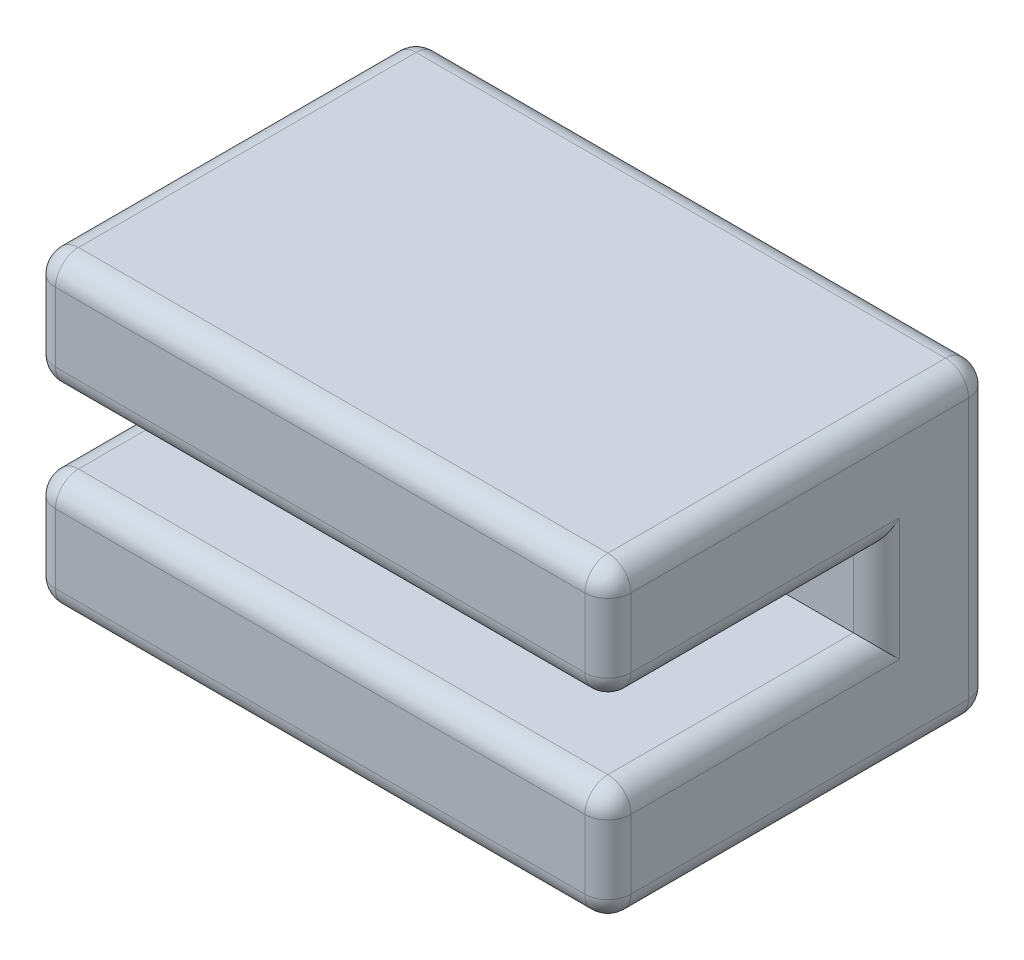
ISO-10303-21;
HEADER;
FILE_DESCRIPTION(('STEP AP214'),'2;1');
FILE_NAME('part.step','',(''),(''),'','','');
FILE_SCHEMA(('AUTOMOTIVE_DESIGN { 1 0 10303 214 1 1 1 1 }'));
ENDSEC;
DATA;
#1=APPLICATION_CONTEXT('core data for automotive mechanical design processes');
#2=APPLICATION_PROTOCOL_DEFINITION('international standard','automotive_design',2000,#1);
#3=PRODUCT_CONTEXT('',#1,'mechanical');
#4=PRODUCT('Part','Part','',(#3));
#5=PRODUCT_RELATED_PRODUCT_CATEGORY('part','',(#4));
#6=PRODUCT_DEFINITION_FORMATION('','',#4);
#7=PRODUCT_DEFINITION_CONTEXT('part definition',#1,'design');
#8=PRODUCT_DEFINITION('design','',#6,#7);
#9=PRODUCT_DEFINITION_SHAPE('','',#8);
#10=(LENGTH_UNIT() NAMED_UNIT(*) SI_UNIT(.MILLI.,.METRE.));
#11=(NAMED_UNIT(*) PLANE_ANGLE_UNIT() SI_UNIT($,.RADIAN.));
#12=(NAMED_UNIT(*) SI_UNIT($,.STERADIAN.) SOLID_ANGLE_UNIT());
#13=UNCERTAINTY_MEASURE_WITH_UNIT(LENGTH_MEASURE(1.E-05),#10,'distance_accuracy_value','');
#14=(GEOMETRIC_REPRESENTATION_CONTEXT(3) GLOBAL_UNCERTAINTY_ASSIGNED_CONTEXT((#13)) GLOBAL_UNIT_ASSIGNED_CONTEXT((#10,
#11,#12)) REPRESENTATION_CONTEXT('',''));
#15=CARTESIAN_POINT('',(0.,0.,0.));
#16=DIRECTION('',(0.,0.,1.));
#17=DIRECTION('',(1.,0.,0.));
#18=AXIS2_PLACEMENT_3D('',#15,#16,#17);
#19=CARTESIAN_POINT('',(0.,0.,10.));
#20=DIRECTION('',(0.,0.,1.));
#21=DIRECTION('',(1.,0.,0.));
#22=AXIS2_PLACEMENT_3D('',#19,#20,#21);
#23=PLANE('',#22);
#24=DIRECTION('',(0.,1.,0.));
#25=VECTOR('',#24,1.);
#26=CARTESIAN_POINT('',(-0.6,8.,10.));
#27=LINE('',#26,#25);
#28=CARTESIAN_POINT('',(-0.6,5.6,10.));
#29=VERTEX_POINT('',#28);
#30=CARTESIAN_POINT('',(-0.6,7.4,10.));
#31=VERTEX_POINT('',#30);
#32=EDGE_CURVE('E288',#29,#31,#27,.T.);
#33=ORIENTED_EDGE('',*,*,#32,.T.);
#34=DIRECTION('',(-1.,0.,0.));
#35=VECTOR('',#34,1.);
#36=CARTESIAN_POINT('',(-15.,7.4,10.));
#37=LINE('',#36,#35);
#38=CARTESIAN_POINT('',(-14.4,7.4,10.));
#39=VERTEX_POINT('',#38);
#40=EDGE_CURVE('E291',#31,#39,#37,.T.);
#41=ORIENTED_EDGE('',*,*,#40,.T.);
#42=DIRECTION('',(0.,-1.,0.));
#43=VECTOR('',#42,1.);
#44=CARTESIAN_POINT('',(-14.4,5.,10.));
#45=LINE('',#44,#43);
#46=CARTESIAN_POINT('',(-14.4,5.6,10.));
#47=VERTEX_POINT('',#46);
#48=EDGE_CURVE('E282',#39,#47,#45,.T.);
#49=ORIENTED_EDGE('',*,*,#48,.T.);
#50=DIRECTION('',(-1.,0.,0.));
#51=VECTOR('',#50,1.);
#52=CARTESIAN_POINT('',(0.,5.6,10.));
#53=LINE('',#52,#51);
#54=EDGE_CURVE('E285',#47,#29,#53,.F.);
#55=ORIENTED_EDGE('',*,*,#54,.T.);
#56=EDGE_LOOP('',(#33,#41,#49,#55));
#57=FACE_BOUND('',#56,.T.);
#58=ADVANCED_FACE('F39',(#57),#23,.T.);
#59=CARTESIAN_POINT('',(0.,0.,10.));
#60=DIRECTION('',(-1.,0.,0.));
#61=DIRECTION('',(0.,0.,1.));
#62=AXIS2_PLACEMENT_3D('',#59,#60,#61);
#63=PLANE('',#62);
#64=DIRECTION('',(0.,0.,1.));
#65=VECTOR('',#64,1.);
#66=CARTESIAN_POINT('',(0.,5.6,10.));
#67=LINE('',#66,#65);
#68=CARTESIAN_POINT('',(0.,5.6,9.4));
#69=VERTEX_POINT('',#68);
#70=CARTESIAN_POINT('',(0.,5.6,2.4));
#71=VERTEX_POINT('',#70);
#72=EDGE_CURVE('E251',#69,#71,#67,.F.);
#73=ORIENTED_EDGE('',*,*,#72,.T.);
#74=DIRECTION('',(0.,1.,0.));
#75=VECTOR('',#74,1.);
#76=CARTESIAN_POINT('',(0.,0.,2.4));
#77=LINE('',#76,#75);
#78=CARTESIAN_POINT('',(0.,2.4,2.4));
#79=VERTEX_POINT('',#78);
#80=EDGE_CURVE('E254',#71,#79,#77,.F.);
#81=ORIENTED_EDGE('',*,*,#80,.T.);
#82=DIRECTION('',(0.,0.,1.));
#83=VECTOR('',#82,1.);
#84=CARTESIAN_POINT('',(0.,2.4,10.));
#85=LINE('',#84,#83);
#86=CARTESIAN_POINT('',(0.,2.4,9.4));
#87=VERTEX_POINT('',#86);
#88=EDGE_CURVE('E243',#79,#87,#85,.T.);
#89=ORIENTED_EDGE('',*,*,#88,.T.);
#90=DIRECTION('',(0.,1.,0.));
#91=VECTOR('',#90,1.);
#92=CARTESIAN_POINT('',(0.,0.,9.4));
#93=LINE('',#92,#91);
#94=CARTESIAN_POINT('',(0.,0.6,9.4));
#95=VERTEX_POINT('',#94);
#96=EDGE_CURVE('E240',#87,#95,#93,.F.);
#97=ORIENTED_EDGE('',*,*,#96,.T.);
#98=DIRECTION('',(0.,0.,-1.));
#99=VECTOR('',#98,1.);
#100=CARTESIAN_POINT('',(0.,0.6,10.));
#101=LINE('',#100,#99);
#102=CARTESIAN_POINT('',(0.,0.6,0.6));
#103=VERTEX_POINT('',#102);
#104=EDGE_CURVE('E233',#95,#103,#101,.T.);
#105=ORIENTED_EDGE('',*,*,#104,.T.);
#106=DIRECTION('',(0.,1.,0.));
#107=VECTOR('',#106,1.);
#108=CARTESIAN_POINT('',(0.,0.,0.6));
#109=LINE('',#108,#107);
#110=CARTESIAN_POINT('',(0.,7.4,0.6));
#111=VERTEX_POINT('',#110);
#112=EDGE_CURVE('E229',#103,#111,#109,.T.);
#113=ORIENTED_EDGE('',*,*,#112,.T.);
#114=DIRECTION('',(0.,0.,-1.));
#115=VECTOR('',#114,1.);
#116=CARTESIAN_POINT('',(0.,7.4,10.));
#117=LINE('',#116,#115);
#118=CARTESIAN_POINT('',(0.,7.4,9.4));
#119=VERTEX_POINT('',#118);
#120=EDGE_CURVE('E196',#111,#119,#117,.F.);
#121=ORIENTED_EDGE('',*,*,#120,.T.);
#122=DIRECTION('',(0.,1.,0.));
#123=VECTOR('',#122,1.);
#124=CARTESIAN_POINT('',(0.,5.,9.4));
#125=LINE('',#124,#123);
#126=EDGE_CURVE('E248',#119,#69,#125,.F.);
#127=ORIENTED_EDGE('',*,*,#126,.T.);
#128=EDGE_LOOP('',(#73,#81,#89,#97,#105,#113,#121,#127));
#129=FACE_BOUND('',#128,.T.);
#130=ADVANCED_FACE('F534',(#129),#63,.F.);
#131=CARTESIAN_POINT('',(0.,8.,10.));
#132=DIRECTION('',(0.,-1.,0.));
#133=DIRECTION('',(1.,0.,0.));
#134=AXIS2_PLACEMENT_3D('',#131,#132,#133);
#135=PLANE('',#134);
#136=DIRECTION('',(-1.,0.,0.));
#137=VECTOR('',#136,1.);
#138=CARTESIAN_POINT('',(0.,8.,9.4));
#139=LINE('',#138,#137);
#140=CARTESIAN_POINT('',(-14.4,8.,9.4));
#141=VERTEX_POINT('',#140);
#142=CARTESIAN_POINT('',(-0.6,8.,9.4));
#143=VERTEX_POINT('',#142);
#144=EDGE_CURVE('E226',#141,#143,#139,.F.);
#145=ORIENTED_EDGE('',*,*,#144,.T.);
#146=DIRECTION('',(0.,0.,-1.));
#147=VECTOR('',#146,1.);
#148=CARTESIAN_POINT('',(-0.6,8.,10.));
#149=LINE('',#148,#147);
#150=CARTESIAN_POINT('',(-0.6,8.,0.6));
#151=VERTEX_POINT('',#150);
#152=EDGE_CURVE('E194',#143,#151,#149,.T.);
#153=ORIENTED_EDGE('',*,*,#152,.T.);
#154=DIRECTION('',(-1.,0.,0.));
#155=VECTOR('',#154,1.);
#156=CARTESIAN_POINT('',(0.,8.,0.6));
#157=LINE('',#156,#155);
#158=CARTESIAN_POINT('',(-14.4,8.,0.6));
#159=VERTEX_POINT('',#158);
#160=EDGE_CURVE('E214',#151,#159,#157,.T.);
#161=ORIENTED_EDGE('',*,*,#160,.T.);
#162=DIRECTION('',(0.,0.,-1.));
#163=VECTOR('',#162,1.);
#164=CARTESIAN_POINT('',(-14.4,8.,10.));
#165=LINE('',#164,#163);
#166=EDGE_CURVE('E221',#159,#141,#165,.F.);
#167=ORIENTED_EDGE('',*,*,#166,.T.);
#168=EDGE_LOOP('',(#145,#153,#161,#167));
#169=FACE_BOUND('',#168,.T.);
#170=ADVANCED_FACE('F224',(#169),#135,.F.);
#171=CARTESIAN_POINT('',(-15.,0.,10.));
#172=DIRECTION('',(1.,0.,0.));
#173=DIRECTION('',(0.,0.,-1.));
#174=AXIS2_PLACEMENT_3D('',#171,#172,#173);
#175=PLANE('',#174);
#176=DIRECTION('',(0.,0.,1.));
#177=VECTOR('',#176,1.);
#178=CARTESIAN_POINT('',(-15.,5.6,10.));
#179=LINE('',#178,#177);
#180=CARTESIAN_POINT('',(-15.,5.6,2.4));
#181=VERTEX_POINT('',#180);
#182=CARTESIAN_POINT('',(-15.,5.6,9.4));
#183=VERTEX_POINT('',#182);
#184=EDGE_CURVE('E340',#181,#183,#179,.T.);
#185=ORIENTED_EDGE('',*,*,#184,.T.);
#186=DIRECTION('',(0.,-1.,0.));
#187=VECTOR('',#186,1.);
#188=CARTESIAN_POINT('',(-15.,8.,9.4));
#189=LINE('',#188,#187);
#190=CARTESIAN_POINT('',(-15.,7.4,9.4));
#191=VERTEX_POINT('',#190);
#192=EDGE_CURVE('E343',#183,#191,#189,.F.);
#193=ORIENTED_EDGE('',*,*,#192,.T.);
#194=DIRECTION('',(0.,0.,-1.));
#195=VECTOR('',#194,1.);
#196=CARTESIAN_POINT('',(-15.,7.4,10.));
#197=LINE('',#196,#195);
#198=CARTESIAN_POINT('',(-15.,7.4,0.6));
#199=VERTEX_POINT('',#198);
#200=EDGE_CURVE('E324',#191,#199,#197,.T.);
#201=ORIENTED_EDGE('',*,*,#200,.T.);
#202=DIRECTION('',(0.,-1.,0.));
#203=VECTOR('',#202,1.);
#204=CARTESIAN_POINT('',(-15.,0.,0.6));
#205=LINE('',#204,#203);
#206=CARTESIAN_POINT('',(-15.,0.599999999999998,0.6));
#207=VERTEX_POINT('',#206);
#208=EDGE_CURVE('E321',#199,#207,#205,.T.);
#209=ORIENTED_EDGE('',*,*,#208,.T.);
#210=DIRECTION('',(0.,0.,-1.));
#211=VECTOR('',#210,1.);
#212=CARTESIAN_POINT('',(-15.,0.599999999999998,10.));
#213=LINE('',#212,#211);
#214=CARTESIAN_POINT('',(-15.,0.599999999999998,9.4));
#215=VERTEX_POINT('',#214);
#216=EDGE_CURVE('E327',#207,#215,#213,.F.);
#217=ORIENTED_EDGE('',*,*,#216,.T.);
#218=DIRECTION('',(0.,-1.,0.));
#219=VECTOR('',#218,1.);
#220=CARTESIAN_POINT('',(-15.,3.,9.4));
#221=LINE('',#220,#219);
#222=CARTESIAN_POINT('',(-15.,2.4,9.4));
#223=VERTEX_POINT('',#222);
#224=EDGE_CURVE('E330',#215,#223,#221,.F.);
#225=ORIENTED_EDGE('',*,*,#224,.T.);
#226=DIRECTION('',(0.,0.,1.));
#227=VECTOR('',#226,1.);
#228=CARTESIAN_POINT('',(-15.,2.4,10.));
#229=LINE('',#228,#227);
#230=CARTESIAN_POINT('',(-15.,2.4,2.4));
#231=VERTEX_POINT('',#230);
#232=EDGE_CURVE('E333',#223,#231,#229,.F.);
#233=ORIENTED_EDGE('',*,*,#232,.T.);
#234=DIRECTION('',(0.,-1.,0.));
#235=VECTOR('',#234,1.);
#236=CARTESIAN_POINT('',(-15.,0.,2.4));
#237=LINE('',#236,#235);
#238=EDGE_CURVE('E337',#231,#181,#237,.F.);
#239=ORIENTED_EDGE('',*,*,#238,.T.);
#240=EDGE_LOOP('',(#185,#193,#201,#209,#217,#225,#233,#239));
#241=FACE_BOUND('',#240,.T.);
#242=ADVANCED_FACE('F592',(#241),#175,.F.);
#243=CARTESIAN_POINT('',(0.,0.,10.));
#244=DIRECTION('',(0.,1.,0.));
#245=DIRECTION('',(-1.,0.,0.));
#246=AXIS2_PLACEMENT_3D('',#243,#244,#245);
#247=PLANE('',#246);
#248=DIRECTION('',(0.,0.,-1.));
#249=VECTOR('',#248,1.);
#250=CARTESIAN_POINT('',(-0.6,0.,10.));
#251=LINE('',#250,#249);
#252=CARTESIAN_POINT('',(-0.6,0.,0.6));
#253=VERTEX_POINT('',#252);
#254=CARTESIAN_POINT('',(-0.6,0.,9.4));
#255=VERTEX_POINT('',#254);
#256=EDGE_CURVE('E314',#253,#255,#251,.F.);
#257=ORIENTED_EDGE('',*,*,#256,.T.);
#258=DIRECTION('',(1.,0.,0.));
#259=VECTOR('',#258,1.);
#260=CARTESIAN_POINT('',(-15.,0.,9.4));
#261=LINE('',#260,#259);
#262=CARTESIAN_POINT('',(-14.4,0.,9.4));
#263=VERTEX_POINT('',#262);
#264=EDGE_CURVE('E317',#255,#263,#261,.F.);
#265=ORIENTED_EDGE('',*,*,#264,.T.);
#266=DIRECTION('',(0.,0.,-1.));
#267=VECTOR('',#266,1.);
#268=CARTESIAN_POINT('',(-14.4,0.,10.));
#269=LINE('',#268,#267);
#270=CARTESIAN_POINT('',(-14.4,0.,0.6));
#271=VERTEX_POINT('',#270);
#272=EDGE_CURVE('E311',#263,#271,#269,.T.);
#273=ORIENTED_EDGE('',*,*,#272,.T.);
#274=DIRECTION('',(1.,0.,0.));
#275=VECTOR('',#274,1.);
#276=CARTESIAN_POINT('',(0.,0.,0.6));
#277=LINE('',#276,#275);
#278=EDGE_CURVE('E308',#271,#253,#277,.T.);
#279=ORIENTED_EDGE('',*,*,#278,.T.);
#280=EDGE_LOOP('',(#257,#265,#273,#279));
#281=FACE_BOUND('',#280,.T.);
#282=ADVANCED_FACE('F553',(#281),#247,.F.);
#283=DIRECTION('',(1.,0.,0.));
#284=VECTOR('',#283,1.);
#285=CARTESIAN_POINT('',(0.,0.6,10.));
#286=LINE('',#285,#284);
#287=CARTESIAN_POINT('',(-14.4,0.599999999999998,10.));
#288=VERTEX_POINT('',#287);
#289=CARTESIAN_POINT('',(-0.6,0.6,10.));
#290=VERTEX_POINT('',#289);
#291=EDGE_CURVE('E298',#288,#290,#286,.T.);
#292=ORIENTED_EDGE('',*,*,#291,.T.);
#293=DIRECTION('',(0.,1.,0.));
#294=VECTOR('',#293,1.);
#295=CARTESIAN_POINT('',(-0.6,3.,10.));
#296=LINE('',#295,#294);
#297=CARTESIAN_POINT('',(-0.6,2.4,10.));
#298=VERTEX_POINT('',#297);
#299=EDGE_CURVE('E304',#290,#298,#296,.T.);
#300=ORIENTED_EDGE('',*,*,#299,.T.);
#301=DIRECTION('',(1.,0.,0.));
#302=VECTOR('',#301,1.);
#303=CARTESIAN_POINT('',(-15.,2.4,10.));
#304=LINE('',#303,#302);
#305=CARTESIAN_POINT('',(-14.4,2.4,10.));
#306=VERTEX_POINT('',#305);
#307=EDGE_CURVE('E301',#298,#306,#304,.F.);
#308=ORIENTED_EDGE('',*,*,#307,.T.);
#309=DIRECTION('',(0.,-1.,0.));
#310=VECTOR('',#309,1.);
#311=CARTESIAN_POINT('',(-14.4,0.,10.));
#312=LINE('',#311,#310);
#313=EDGE_CURVE('E295',#306,#288,#312,.T.);
#314=ORIENTED_EDGE('',*,*,#313,.T.);
#315=EDGE_LOOP('',(#292,#300,#308,#314));
#316=FACE_BOUND('',#315,.T.);
#317=ADVANCED_FACE('F544',(#316),#23,.T.);
#318=CARTESIAN_POINT('',(0.,0.,0.));
#319=DIRECTION('',(0.,0.,1.));
#320=DIRECTION('',(1.,0.,0.));
#321=AXIS2_PLACEMENT_3D('',#318,#319,#320);
#322=PLANE('',#321);
#323=DIRECTION('',(0.,-1.,0.));
#324=VECTOR('',#323,1.);
#325=CARTESIAN_POINT('',(-14.4,0.,0.));
#326=LINE('',#325,#324);
#327=CARTESIAN_POINT('',(-14.4,0.599999999999998,0.));
#328=VERTEX_POINT('',#327);
#329=CARTESIAN_POINT('',(-14.4,7.4,0.));
#330=VERTEX_POINT('',#329);
#331=EDGE_CURVE('E49',#328,#330,#326,.F.);
#332=ORIENTED_EDGE('',*,*,#331,.T.);
#333=DIRECTION('',(-1.,0.,0.));
#334=VECTOR('',#333,1.);
#335=CARTESIAN_POINT('',(0.,7.4,0.));
#336=LINE('',#335,#334);
#337=CARTESIAN_POINT('',(-0.6,7.4,0.));
#338=VERTEX_POINT('',#337);
#339=EDGE_CURVE('E11',#330,#338,#336,.F.);
#340=ORIENTED_EDGE('',*,*,#339,.T.);
#341=DIRECTION('',(0.,1.,0.));
#342=VECTOR('',#341,1.);
#343=CARTESIAN_POINT('',(-0.6,0.,0.));
#344=LINE('',#343,#342);
#345=CARTESIAN_POINT('',(-0.6,0.6,0.));
#346=VERTEX_POINT('',#345);
#347=EDGE_CURVE('E346',#338,#346,#344,.F.);
#348=ORIENTED_EDGE('',*,*,#347,.T.);
#349=DIRECTION('',(1.,0.,0.));
#350=VECTOR('',#349,1.);
#351=CARTESIAN_POINT('',(0.,0.6,0.));
#352=LINE('',#351,#350);
#353=EDGE_CURVE('E60',#346,#328,#352,.F.);
#354=ORIENTED_EDGE('',*,*,#353,.T.);
#355=EDGE_LOOP('',(#332,#340,#348,#354));
#356=FACE_BOUND('',#355,.T.);
#357=ADVANCED_FACE('F541',(#356),#322,.F.);
#358=CARTESIAN_POINT('',(-15.,5.,3.));
#359=DIRECTION('',(0.,1.,0.));
#360=DIRECTION('',(0.,0.,1.));
#361=AXIS2_PLACEMENT_3D('',#358,#359,#360);
#362=PLANE('',#361);
#363=DIRECTION('',(-1.,0.,0.));
#364=VECTOR('',#363,1.);
#365=CARTESIAN_POINT('',(-15.,5.,3.));
#366=LINE('',#365,#364);
#367=CARTESIAN_POINT('',(-0.6,5.,3.));
#368=VERTEX_POINT('',#367);
#369=CARTESIAN_POINT('',(-14.4,5.,3.));
#370=VERTEX_POINT('',#369);
#371=EDGE_CURVE('E222',#368,#370,#366,.T.);
#372=ORIENTED_EDGE('',*,*,#371,.F.);
#373=DIRECTION('',(0.,0.,1.));
#374=VECTOR('',#373,1.);
#375=CARTESIAN_POINT('',(-0.6,5.,3.));
#376=LINE('',#375,#374);
#377=CARTESIAN_POINT('',(-0.6,5.,9.4));
#378=VERTEX_POINT('',#377);
#379=EDGE_CURVE('E279',#368,#378,#376,.T.);
#380=ORIENTED_EDGE('',*,*,#379,.T.);
#381=DIRECTION('',(-1.,0.,0.));
#382=VECTOR('',#381,1.);
#383=CARTESIAN_POINT('',(-15.,5.,9.4));
#384=LINE('',#383,#382);
#385=CARTESIAN_POINT('',(-14.4,5.,9.4));
#386=VERTEX_POINT('',#385);
#387=EDGE_CURVE('E276',#378,#386,#384,.T.);
#388=ORIENTED_EDGE('',*,*,#387,.T.);
#389=DIRECTION('',(0.,0.,1.));
#390=VECTOR('',#389,1.);
#391=CARTESIAN_POINT('',(-14.4,5.,3.));
#392=LINE('',#391,#390);
#393=EDGE_CURVE('E273',#386,#370,#392,.F.);
#394=ORIENTED_EDGE('',*,*,#393,.T.);
#395=EDGE_LOOP('',(#372,#380,#388,#394));
#396=FACE_BOUND('',#395,.T.);
#397=ADVANCED_FACE('F543',(#396),#362,.F.);
#398=CARTESIAN_POINT('',(-15.,3.,3.));
#399=DIRECTION('',(0.,-1.,0.));
#400=DIRECTION('',(0.,0.,-1.));
#401=AXIS2_PLACEMENT_3D('',#398,#399,#400);
#402=PLANE('',#401);
#403=DIRECTION('',(1.,0.,0.));
#404=VECTOR('',#403,1.);
#405=CARTESIAN_POINT('',(0.,3.,9.4));
#406=LINE('',#405,#404);
#407=CARTESIAN_POINT('',(-14.4,3.,9.4));
#408=VERTEX_POINT('',#407);
#409=CARTESIAN_POINT('',(-0.6,3.,9.4));
#410=VERTEX_POINT('',#409);
#411=EDGE_CURVE('E260',#408,#410,#406,.T.);
#412=ORIENTED_EDGE('',*,*,#411,.T.);
#413=DIRECTION('',(0.,0.,1.));
#414=VECTOR('',#413,1.);
#415=CARTESIAN_POINT('',(-0.6,3.,3.));
#416=LINE('',#415,#414);
#417=CARTESIAN_POINT('',(-0.6,3.,3.));
#418=VERTEX_POINT('',#417);
#419=EDGE_CURVE('E263',#410,#418,#416,.F.);
#420=ORIENTED_EDGE('',*,*,#419,.T.);
#421=DIRECTION('',(1.,0.,0.));
#422=VECTOR('',#421,1.);
#423=CARTESIAN_POINT('',(-15.,3.,3.));
#424=LINE('',#423,#422);
#425=CARTESIAN_POINT('',(-14.4,3.,3.));
#426=VERTEX_POINT('',#425);
#427=EDGE_CURVE('E496',#426,#418,#424,.T.);
#428=ORIENTED_EDGE('',*,*,#427,.F.);
#429=DIRECTION('',(0.,0.,1.));
#430=VECTOR('',#429,1.);
#431=CARTESIAN_POINT('',(-14.4,3.,3.));
#432=LINE('',#431,#430);
#433=EDGE_CURVE('E257',#426,#408,#432,.T.);
#434=ORIENTED_EDGE('',*,*,#433,.T.);
#435=EDGE_LOOP('',(#412,#420,#428,#434));
#436=FACE_BOUND('',#435,.T.);
#437=ADVANCED_FACE('F550',(#436),#402,.F.);
#438=CARTESIAN_POINT('',(0.,0.,3.));
#439=DIRECTION('',(0.,0.,-1.));
#440=DIRECTION('',(-1.,0.,0.));
#441=AXIS2_PLACEMENT_3D('',#438,#439,#440);
#442=PLANE('',#441);
#443=ORIENTED_EDGE('',*,*,#427,.T.);
#444=DIRECTION('',(0.,1.,0.));
#445=VECTOR('',#444,1.);
#446=CARTESIAN_POINT('',(-0.6,0.,3.));
#447=LINE('',#446,#445);
#448=EDGE_CURVE('E270',#418,#368,#447,.T.);
#449=ORIENTED_EDGE('',*,*,#448,.T.);
#450=ORIENTED_EDGE('',*,*,#371,.T.);
#451=DIRECTION('',(0.,-1.,0.));
#452=VECTOR('',#451,1.);
#453=CARTESIAN_POINT('',(-14.4,0.,3.));
#454=LINE('',#453,#452);
#455=EDGE_CURVE('E267',#370,#426,#454,.T.);
#456=ORIENTED_EDGE('',*,*,#455,.T.);
#457=EDGE_LOOP('',(#443,#449,#450,#456));
#458=FACE_BOUND('',#457,.T.);
#459=ADVANCED_FACE('F565',(#458),#442,.F.);
#460=CARTESIAN_POINT('',(-14.4,2.4,9.4));
#461=DIRECTION('',(-1.,0.,0.));
#462=DIRECTION('',(0.,0.,1.));
#463=AXIS2_PLACEMENT_3D('',#460,#461,#462);
#464=SPHERICAL_SURFACE('',#463,0.6);
#465=CARTESIAN_POINT('',(-14.4,2.4,9.4));
#466=DIRECTION('',(-1.,0.,0.));
#467=DIRECTION('',(0.,0.,1.));
#468=AXIS2_PLACEMENT_3D('',#465,#466,#467);
#469=CIRCLE('',#468,0.6);
#470=EDGE_CURVE('E483',#408,#306,#469,.F.);
#471=ORIENTED_EDGE('',*,*,#470,.F.);
#472=CARTESIAN_POINT('',(-14.4,2.4,9.4));
#473=DIRECTION('',(0.,0.,1.));
#474=DIRECTION('',(1.,0.,0.));
#475=AXIS2_PLACEMENT_3D('',#472,#473,#474);
#476=CIRCLE('',#475,0.6);
#477=EDGE_CURVE('E43',#223,#408,#476,.F.);
#478=ORIENTED_EDGE('',*,*,#477,.F.);
#479=CARTESIAN_POINT('',(-14.4,2.4,9.4));
#480=DIRECTION('',(0.,1.,0.));
#481=DIRECTION('',(0.,0.,1.));
#482=AXIS2_PLACEMENT_3D('',#479,#480,#481);
#483=CIRCLE('',#482,0.6);
#484=EDGE_CURVE('E486',#306,#223,#483,.F.);
#485=ORIENTED_EDGE('',*,*,#484,.F.);
#486=EDGE_LOOP('',(#471,#478,#485));
#487=FACE_BOUND('',#486,.T.);
#488=ADVANCED_FACE('F41',(#487),#464,.T.);
#489=CARTESIAN_POINT('',(-14.4,2.4,3.));
#490=DIRECTION('',(0.,0.,1.));
#491=DIRECTION('',(1.,0.,0.));
#492=AXIS2_PLACEMENT_3D('',#489,#490,#491);
#493=CYLINDRICAL_SURFACE('',#492,0.6);
#494=ORIENTED_EDGE('',*,*,#477,.T.);
#495=ORIENTED_EDGE('',*,*,#433,.F.);
#496=CARTESIAN_POINT('',(-14.4,2.4,2.4));
#497=DIRECTION('',(0.,-0.707106781186547,0.707106781186547));
#498=DIRECTION('',(0.,0.707106781186547,0.707106781186547));
#499=AXIS2_PLACEMENT_3D('',#496,#497,#498);
#500=ELLIPSE('',#499,0.848528137423857,0.6);
#501=EDGE_CURVE('E479',#231,#426,#500,.F.);
#502=ORIENTED_EDGE('',*,*,#501,.F.);
#503=ORIENTED_EDGE('',*,*,#232,.F.);
#504=EDGE_LOOP('',(#494,#495,#502,#503));
#505=FACE_BOUND('',#504,.T.);
#506=ADVANCED_FACE('F572',(#505),#493,.T.);
#507=CARTESIAN_POINT('',(-14.4,0.,9.4));
#508=DIRECTION('',(0.,1.,0.));
#509=DIRECTION('',(0.,0.,1.));
#510=AXIS2_PLACEMENT_3D('',#507,#508,#509);
#511=CYLINDRICAL_SURFACE('',#510,0.6);
#512=ORIENTED_EDGE('',*,*,#484,.T.);
#513=ORIENTED_EDGE('',*,*,#224,.F.);
#514=CARTESIAN_POINT('',(-14.4,0.599999999999998,9.4));
#515=DIRECTION('',(0.,-1.,0.));
#516=DIRECTION('',(0.,0.,-1.));
#517=AXIS2_PLACEMENT_3D('',#514,#515,#516);
#518=CIRCLE('',#517,0.6);
#519=EDGE_CURVE('E475',#288,#215,#518,.T.);
#520=ORIENTED_EDGE('',*,*,#519,.F.);
#521=ORIENTED_EDGE('',*,*,#313,.F.);
#522=EDGE_LOOP('',(#512,#513,#520,#521));
#523=FACE_BOUND('',#522,.T.);
#524=ADVANCED_FACE('F577',(#523),#511,.T.);
#525=CARTESIAN_POINT('',(-15.,2.4,9.4));
#526=DIRECTION('',(-1.,0.,0.));
#527=DIRECTION('',(0.,0.,1.));
#528=AXIS2_PLACEMENT_3D('',#525,#526,#527);
#529=CYLINDRICAL_SURFACE('',#528,0.6);
#530=ORIENTED_EDGE('',*,*,#470,.T.);
#531=ORIENTED_EDGE('',*,*,#307,.F.);
#532=CARTESIAN_POINT('',(-0.6,2.4,9.4));
#533=DIRECTION('',(1.,0.,0.));
#534=DIRECTION('',(0.,0.,-1.));
#535=AXIS2_PLACEMENT_3D('',#532,#533,#534);
#536=CIRCLE('',#535,0.6);
#537=EDGE_CURVE('E471',#410,#298,#536,.T.);
#538=ORIENTED_EDGE('',*,*,#537,.F.);
#539=ORIENTED_EDGE('',*,*,#411,.F.);
#540=EDGE_LOOP('',(#530,#531,#538,#539));
#541=FACE_BOUND('',#540,.T.);
#542=ADVANCED_FACE('F582',(#541),#529,.T.);
#543=CARTESIAN_POINT('',(-14.4,0.,2.4));
#544=DIRECTION('',(0.,-1.,0.));
#545=DIRECTION('',(0.,0.,-1.));
#546=AXIS2_PLACEMENT_3D('',#543,#544,#545);
#547=CYLINDRICAL_SURFACE('',#546,0.6);
#548=ORIENTED_EDGE('',*,*,#501,.T.);
#549=ORIENTED_EDGE('',*,*,#455,.F.);
#550=CARTESIAN_POINT('',(-14.4,5.6,2.4));
#551=DIRECTION('',(0.,0.707106781186547,0.707106781186547));
#552=DIRECTION('',(0.,-0.707106781186547,0.707106781186547));
#553=AXIS2_PLACEMENT_3D('',#550,#551,#552);
#554=ELLIPSE('',#553,0.848528137423857,0.6);
#555=EDGE_CURVE('E463',#181,#370,#554,.T.);
#556=ORIENTED_EDGE('',*,*,#555,.F.);
#557=ORIENTED_EDGE('',*,*,#238,.F.);
#558=EDGE_LOOP('',(#548,#549,#556,#557));
#559=FACE_BOUND('',#558,.T.);
#560=ADVANCED_FACE('F588',(#559),#547,.T.);
#561=CARTESIAN_POINT('',(-14.4,0.599999999999998,9.4));
#562=DIRECTION('',(-1.,0.,0.));
#563=DIRECTION('',(0.,0.,1.));
#564=AXIS2_PLACEMENT_3D('',#561,#562,#563);
#565=SPHERICAL_SURFACE('',#564,0.6);
#566=CARTESIAN_POINT('',(-14.4,0.599999999999998,9.4));
#567=DIRECTION('',(-1.,0.,0.));
#568=DIRECTION('',(0.,0.,1.));
#569=AXIS2_PLACEMENT_3D('',#566,#567,#568);
#570=CIRCLE('',#569,0.6);
#571=EDGE_CURVE('E455',#288,#263,#570,.F.);
#572=ORIENTED_EDGE('',*,*,#571,.F.);
#573=ORIENTED_EDGE('',*,*,#519,.T.);
#574=CARTESIAN_POINT('',(-14.4,0.599999999999998,9.4));
#575=DIRECTION('',(0.,0.,1.));
#576=DIRECTION('',(1.,0.,0.));
#577=AXIS2_PLACEMENT_3D('',#574,#575,#576);
#578=CIRCLE('',#577,0.6);
#579=EDGE_CURVE('E459',#263,#215,#578,.F.);
#580=ORIENTED_EDGE('',*,*,#579,.F.);
#581=EDGE_LOOP('',(#572,#573,#580));
#582=FACE_BOUND('',#581,.T.);
#583=ADVANCED_FACE('F599',(#582),#565,.T.);
#584=CARTESIAN_POINT('',(-0.6,2.4,9.4));
#585=DIRECTION('',(0.,1.,0.));
#586=DIRECTION('',(0.,0.,1.));
#587=AXIS2_PLACEMENT_3D('',#584,#585,#586);
#588=SPHERICAL_SURFACE('',#587,0.6);
#589=CARTESIAN_POINT('',(-0.6,2.4,9.4));
#590=DIRECTION('',(0.,1.,0.));
#591=DIRECTION('',(0.,0.,1.));
#592=AXIS2_PLACEMENT_3D('',#589,#590,#591);
#593=CIRCLE('',#592,0.6);
#594=EDGE_CURVE('E452',#87,#298,#593,.F.);
#595=ORIENTED_EDGE('',*,*,#594,.F.);
#596=CARTESIAN_POINT('',(-0.6,2.4,9.4));
#597=DIRECTION('',(0.,0.,1.));
#598=DIRECTION('',(1.,0.,0.));
#599=AXIS2_PLACEMENT_3D('',#596,#597,#598);
#600=CIRCLE('',#599,0.6);
#601=EDGE_CURVE('E467',#410,#87,#600,.F.);
#602=ORIENTED_EDGE('',*,*,#601,.F.);
#603=ORIENTED_EDGE('',*,*,#537,.T.);
#604=EDGE_LOOP('',(#595,#602,#603));
#605=FACE_BOUND('',#604,.T.);
#606=ADVANCED_FACE('F692',(#605),#588,.T.);
#607=CARTESIAN_POINT('',(-0.6,2.4,10.));
#608=DIRECTION('',(0.,0.,1.));
#609=DIRECTION('',(1.,0.,0.));
#610=AXIS2_PLACEMENT_3D('',#607,#608,#609);
#611=CYLINDRICAL_SURFACE('',#610,0.6);
#612=ORIENTED_EDGE('',*,*,#601,.T.);
#613=ORIENTED_EDGE('',*,*,#88,.F.);
#614=CARTESIAN_POINT('',(-0.6,2.4,2.4));
#615=DIRECTION('',(0.,-0.707106781186547,0.707106781186547));
#616=DIRECTION('',(0.,0.707106781186547,0.707106781186547));
#617=AXIS2_PLACEMENT_3D('',#614,#615,#616);
#618=ELLIPSE('',#617,0.848528137423857,0.6);
#619=EDGE_CURVE('E448',#418,#79,#618,.F.);
#620=ORIENTED_EDGE('',*,*,#619,.F.);
#621=ORIENTED_EDGE('',*,*,#419,.F.);
#622=EDGE_LOOP('',(#612,#613,#620,#621));
#623=FACE_BOUND('',#622,.T.);
#624=ADVANCED_FACE('F688',(#623),#611,.T.);
#625=CARTESIAN_POINT('',(-14.4,5.6,10.));
#626=DIRECTION('',(0.,0.,1.));
#627=DIRECTION('',(1.,0.,0.));
#628=AXIS2_PLACEMENT_3D('',#625,#626,#627);
#629=CYLINDRICAL_SURFACE('',#628,0.6);
#630=ORIENTED_EDGE('',*,*,#555,.T.);
#631=ORIENTED_EDGE('',*,*,#393,.F.);
#632=CARTESIAN_POINT('',(-14.4,5.6,9.4));
#633=DIRECTION('',(0.,0.,1.));
#634=DIRECTION('',(1.,0.,0.));
#635=AXIS2_PLACEMENT_3D('',#632,#633,#634);
#636=CIRCLE('',#635,0.6);
#637=EDGE_CURVE('E444',#183,#386,#636,.T.);
#638=ORIENTED_EDGE('',*,*,#637,.F.);
#639=ORIENTED_EDGE('',*,*,#184,.F.);
#640=EDGE_LOOP('',(#630,#631,#638,#639));
#641=FACE_BOUND('',#640,.T.);
#642=ADVANCED_FACE('F685',(#641),#629,.T.);
#643=CARTESIAN_POINT('',(-14.4,0.599999999999998,10.));
#644=DIRECTION('',(0.,0.,-1.));
#645=DIRECTION('',(-1.,0.,0.));
#646=AXIS2_PLACEMENT_3D('',#643,#644,#645);
#647=CYLINDRICAL_SURFACE('',#646,0.6);
#648=ORIENTED_EDGE('',*,*,#579,.T.);
#649=ORIENTED_EDGE('',*,*,#216,.F.);
#650=CARTESIAN_POINT('',(-14.4,0.599999999999998,0.6));
#651=DIRECTION('',(0.,0.,-1.));
#652=DIRECTION('',(-1.,0.,0.));
#653=AXIS2_PLACEMENT_3D('',#650,#651,#652);
#654=CIRCLE('',#653,0.6);
#655=EDGE_CURVE('E440',#271,#207,#654,.T.);
#656=ORIENTED_EDGE('',*,*,#655,.F.);
#657=ORIENTED_EDGE('',*,*,#272,.F.);
#658=EDGE_LOOP('',(#648,#649,#656,#657));
#659=FACE_BOUND('',#658,.T.);
#660=ADVANCED_FACE('F602',(#659),#647,.T.);
#661=CARTESIAN_POINT('',(0.,0.6,9.4));
#662=DIRECTION('',(-1.,0.,0.));
#663=DIRECTION('',(0.,-1.,0.));
#664=AXIS2_PLACEMENT_3D('',#661,#662,#663);
#665=CYLINDRICAL_SURFACE('',#664,0.6);
#666=ORIENTED_EDGE('',*,*,#571,.T.);
#667=ORIENTED_EDGE('',*,*,#264,.F.);
#668=CARTESIAN_POINT('',(-0.6,0.6,9.4));
#669=DIRECTION('',(1.,0.,0.));
#670=DIRECTION('',(0.,1.,0.));
#671=AXIS2_PLACEMENT_3D('',#668,#669,#670);
#672=CIRCLE('',#671,0.6);
#673=EDGE_CURVE('E436',#290,#255,#672,.T.);
#674=ORIENTED_EDGE('',*,*,#673,.F.);
#675=ORIENTED_EDGE('',*,*,#291,.F.);
#676=EDGE_LOOP('',(#666,#667,#674,#675));
#677=FACE_BOUND('',#676,.T.);
#678=ADVANCED_FACE('F611',(#677),#665,.T.);
#679=CARTESIAN_POINT('',(-0.6,0.,9.4));
#680=DIRECTION('',(0.,-1.,0.));
#681=DIRECTION('',(0.,0.,-1.));
#682=AXIS2_PLACEMENT_3D('',#679,#680,#681);
#683=CYLINDRICAL_SURFACE('',#682,0.6);
#684=ORIENTED_EDGE('',*,*,#594,.T.);
#685=ORIENTED_EDGE('',*,*,#299,.F.);
#686=CARTESIAN_POINT('',(-0.6,0.6,9.4));
#687=DIRECTION('',(0.,-1.,0.));
#688=DIRECTION('',(0.,0.,-1.));
#689=AXIS2_PLACEMENT_3D('',#686,#687,#688);
#690=CIRCLE('',#689,0.6);
#691=EDGE_CURVE('E432',#95,#290,#690,.T.);
#692=ORIENTED_EDGE('',*,*,#691,.F.);
#693=ORIENTED_EDGE('',*,*,#96,.F.);
#694=EDGE_LOOP('',(#684,#685,#692,#693));
#695=FACE_BOUND('',#694,.T.);
#696=ADVANCED_FACE('F676',(#695),#683,.T.);
#697=CARTESIAN_POINT('',(-0.6,0.,2.4));
#698=DIRECTION('',(0.,1.,0.));
#699=DIRECTION('',(0.,0.,1.));
#700=AXIS2_PLACEMENT_3D('',#697,#698,#699);
#701=CYLINDRICAL_SURFACE('',#700,0.6);
#702=ORIENTED_EDGE('',*,*,#619,.T.);
#703=ORIENTED_EDGE('',*,*,#80,.F.);
#704=CARTESIAN_POINT('',(-0.6,5.6,2.4));
#705=DIRECTION('',(0.,0.707106781186547,0.707106781186547));
#706=DIRECTION('',(0.,0.707106781186547,-0.707106781186547));
#707=AXIS2_PLACEMENT_3D('',#704,#705,#706);
#708=ELLIPSE('',#707,0.848528137423857,0.6);
#709=EDGE_CURVE('E428',#368,#71,#708,.T.);
#710=ORIENTED_EDGE('',*,*,#709,.F.);
#711=ORIENTED_EDGE('',*,*,#448,.F.);
#712=EDGE_LOOP('',(#702,#703,#710,#711));
#713=FACE_BOUND('',#712,.T.);
#714=ADVANCED_FACE('F672',(#713),#701,.T.);
#715=CARTESIAN_POINT('',(-14.4,5.6,9.4));
#716=DIRECTION('',(0.,-1.,0.));
#717=DIRECTION('',(0.,0.,-1.));
#718=AXIS2_PLACEMENT_3D('',#715,#716,#717);
#719=SPHERICAL_SURFACE('',#718,0.6);
#720=CARTESIAN_POINT('',(-14.4,5.6,9.4));
#721=DIRECTION('',(0.,-1.,0.));
#722=DIRECTION('',(0.,0.,-1.));
#723=AXIS2_PLACEMENT_3D('',#720,#721,#722);
#724=CIRCLE('',#723,0.6);
#725=EDGE_CURVE('E420',#183,#47,#724,.F.);
#726=ORIENTED_EDGE('',*,*,#725,.F.);
#727=ORIENTED_EDGE('',*,*,#637,.T.);
#728=CARTESIAN_POINT('',(-14.4,5.6,9.4));
#729=DIRECTION('',(-1.,0.,0.));
#730=DIRECTION('',(0.,0.,1.));
#731=AXIS2_PLACEMENT_3D('',#728,#729,#730);
#732=CIRCLE('',#731,0.6);
#733=EDGE_CURVE('E424',#47,#386,#732,.F.);
#734=ORIENTED_EDGE('',*,*,#733,.F.);
#735=EDGE_LOOP('',(#726,#727,#734));
#736=FACE_BOUND('',#735,.T.);
#737=ADVANCED_FACE('F669',(#736),#719,.T.);
#738=CARTESIAN_POINT('',(-14.4,0.599999999999998,0.6));
#739=DIRECTION('',(-1.,0.,0.));
#740=DIRECTION('',(0.,0.,1.));
#741=AXIS2_PLACEMENT_3D('',#738,#739,#740);
#742=SPHERICAL_SURFACE('',#741,0.6);
#743=CARTESIAN_POINT('',(-14.4,0.599999999999998,0.6));
#744=DIRECTION('',(-1.,0.,0.));
#745=DIRECTION('',(0.,0.,1.));
#746=AXIS2_PLACEMENT_3D('',#743,#744,#745);
#747=CIRCLE('',#746,0.6);
#748=EDGE_CURVE('E413',#271,#328,#747,.F.);
#749=ORIENTED_EDGE('',*,*,#748,.F.);
#750=ORIENTED_EDGE('',*,*,#655,.T.);
#751=CARTESIAN_POINT('',(-14.4,0.599999999999998,0.6));
#752=DIRECTION('',(0.,-1.,0.));
#753=DIRECTION('',(0.,0.,-1.));
#754=AXIS2_PLACEMENT_3D('',#751,#752,#753);
#755=CIRCLE('',#754,0.6);
#756=EDGE_CURVE('E416',#328,#207,#755,.F.);
#757=ORIENTED_EDGE('',*,*,#756,.F.);
#758=EDGE_LOOP('',(#749,#750,#757));
#759=FACE_BOUND('',#758,.T.);
#760=ADVANCED_FACE('F625',(#759),#742,.T.);
#761=CARTESIAN_POINT('',(-0.6,0.6,9.4));
#762=DIRECTION('',(0.,0.,1.));
#763=DIRECTION('',(1.,0.,0.));
#764=AXIS2_PLACEMENT_3D('',#761,#762,#763);
#765=SPHERICAL_SURFACE('',#764,0.6);
#766=ORIENTED_EDGE('',*,*,#691,.T.);
#767=ORIENTED_EDGE('',*,*,#673,.T.);
#768=CARTESIAN_POINT('',(-0.6,0.6,9.4));
#769=DIRECTION('',(0.,0.,1.));
#770=DIRECTION('',(1.,0.,0.));
#771=AXIS2_PLACEMENT_3D('',#768,#769,#770);
#772=CIRCLE('',#771,0.6);
#773=EDGE_CURVE('E409',#95,#255,#772,.F.);
#774=ORIENTED_EDGE('',*,*,#773,.F.);
#775=EDGE_LOOP('',(#766,#767,#774));
#776=FACE_BOUND('',#775,.T.);
#777=ADVANCED_FACE('F614',(#776),#765,.T.);
#778=CARTESIAN_POINT('',(-0.6,5.6,3.));
#779=DIRECTION('',(0.,0.,1.));
#780=DIRECTION('',(1.,0.,0.));
#781=AXIS2_PLACEMENT_3D('',#778,#779,#780);
#782=CYLINDRICAL_SURFACE('',#781,0.6);
#783=ORIENTED_EDGE('',*,*,#709,.T.);
#784=ORIENTED_EDGE('',*,*,#72,.F.);
#785=CARTESIAN_POINT('',(-0.6,5.6,9.4));
#786=DIRECTION('',(0.,0.,1.));
#787=DIRECTION('',(1.,0.,0.));
#788=AXIS2_PLACEMENT_3D('',#785,#786,#787);
#789=CIRCLE('',#788,0.6);
#790=EDGE_CURVE('E405',#378,#69,#789,.T.);
#791=ORIENTED_EDGE('',*,*,#790,.F.);
#792=ORIENTED_EDGE('',*,*,#379,.F.);
#793=EDGE_LOOP('',(#783,#784,#791,#792));
#794=FACE_BOUND('',#793,.T.);
#795=ADVANCED_FACE('F660',(#794),#782,.T.);
#796=CARTESIAN_POINT('',(-15.,5.6,9.4));
#797=DIRECTION('',(1.,0.,0.));
#798=DIRECTION('',(0.,0.,-1.));
#799=AXIS2_PLACEMENT_3D('',#796,#797,#798);
#800=CYLINDRICAL_SURFACE('',#799,0.6);
#801=ORIENTED_EDGE('',*,*,#733,.T.);
#802=ORIENTED_EDGE('',*,*,#387,.F.);
#803=CARTESIAN_POINT('',(-0.6,5.6,9.4));
#804=DIRECTION('',(1.,0.,0.));
#805=DIRECTION('',(0.,1.,0.));
#806=AXIS2_PLACEMENT_3D('',#803,#804,#805);
#807=CIRCLE('',#806,0.6);
#808=EDGE_CURVE('E401',#29,#378,#807,.T.);
#809=ORIENTED_EDGE('',*,*,#808,.F.);
#810=ORIENTED_EDGE('',*,*,#54,.F.);
#811=EDGE_LOOP('',(#801,#802,#809,#810));
#812=FACE_BOUND('',#811,.T.);
#813=ADVANCED_FACE('F656',(#812),#800,.T.);
#814=CARTESIAN_POINT('',(-14.4,0.,9.4));
#815=DIRECTION('',(0.,1.,0.));
#816=DIRECTION('',(0.,0.,1.));
#817=AXIS2_PLACEMENT_3D('',#814,#815,#816);
#818=CYLINDRICAL_SURFACE('',#817,0.6);
#819=ORIENTED_EDGE('',*,*,#725,.T.);
#820=ORIENTED_EDGE('',*,*,#48,.F.);
#821=CARTESIAN_POINT('',(-14.4,7.4,9.4));
#822=DIRECTION('',(0.,1.,0.));
#823=DIRECTION('',(0.,0.,1.));
#824=AXIS2_PLACEMENT_3D('',#821,#822,#823);
#825=CIRCLE('',#824,0.6);
#826=EDGE_CURVE('E397',#191,#39,#825,.T.);
#827=ORIENTED_EDGE('',*,*,#826,.F.);
#828=ORIENTED_EDGE('',*,*,#192,.F.);
#829=EDGE_LOOP('',(#819,#820,#827,#828));
#830=FACE_BOUND('',#829,.T.);
#831=ADVANCED_FACE('F653',(#830),#818,.T.);
#832=CARTESIAN_POINT('',(-14.4,7.4,10.));
#833=DIRECTION('',(0.,0.,-1.));
#834=DIRECTION('',(-1.,0.,0.));
#835=AXIS2_PLACEMENT_3D('',#832,#833,#834);
#836=CYLINDRICAL_SURFACE('',#835,0.6);
#837=CARTESIAN_POINT('',(-14.4,7.4,0.6));
#838=DIRECTION('',(0.,0.,-1.));
#839=DIRECTION('',(-1.,0.,0.));
#840=AXIS2_PLACEMENT_3D('',#837,#838,#839);
#841=CIRCLE('',#840,0.6);
#842=EDGE_CURVE('E389',#199,#159,#841,.T.);
#843=ORIENTED_EDGE('',*,*,#842,.F.);
#844=ORIENTED_EDGE('',*,*,#200,.F.);
#845=CARTESIAN_POINT('',(-14.4,7.4,9.4));
#846=DIRECTION('',(0.,0.,1.));
#847=DIRECTION('',(1.,0.,0.));
#848=AXIS2_PLACEMENT_3D('',#845,#846,#847);
#849=CIRCLE('',#848,0.6);
#850=EDGE_CURVE('E393',#141,#191,#849,.T.);
#851=ORIENTED_EDGE('',*,*,#850,.F.);
#852=ORIENTED_EDGE('',*,*,#166,.F.);
#853=EDGE_LOOP('',(#843,#844,#851,#852));
#854=FACE_BOUND('',#853,.T.);
#855=ADVANCED_FACE('F515',(#854),#836,.T.);
#856=CARTESIAN_POINT('',(-14.4,0.,0.6));
#857=DIRECTION('',(0.,-1.,0.));
#858=DIRECTION('',(0.,0.,-1.));
#859=AXIS2_PLACEMENT_3D('',#856,#857,#858);
#860=CYLINDRICAL_SURFACE('',#859,0.6);
#861=ORIENTED_EDGE('',*,*,#756,.T.);
#862=ORIENTED_EDGE('',*,*,#208,.F.);
#863=CARTESIAN_POINT('',(-14.4,7.4,0.6));
#864=DIRECTION('',(0.,1.,0.));
#865=DIRECTION('',(0.,0.,1.));
#866=AXIS2_PLACEMENT_3D('',#863,#864,#865);
#867=CIRCLE('',#866,0.6);
#868=EDGE_CURVE('E385',#330,#199,#867,.T.);
#869=ORIENTED_EDGE('',*,*,#868,.F.);
#870=ORIENTED_EDGE('',*,*,#331,.F.);
#871=EDGE_LOOP('',(#861,#862,#869,#870));
#872=FACE_BOUND('',#871,.T.);
#873=ADVANCED_FACE('F628',(#872),#860,.T.);
#874=CARTESIAN_POINT('',(0.,0.6,0.6));
#875=DIRECTION('',(1.,0.,0.));
#876=DIRECTION('',(0.,1.,0.));
#877=AXIS2_PLACEMENT_3D('',#874,#875,#876);
#878=CYLINDRICAL_SURFACE('',#877,0.6);
#879=ORIENTED_EDGE('',*,*,#748,.T.);
#880=ORIENTED_EDGE('',*,*,#353,.F.);
#881=CARTESIAN_POINT('',(-0.6,0.6,0.6));
#882=DIRECTION('',(1.,0.,0.));
#883=DIRECTION('',(0.,1.,0.));
#884=AXIS2_PLACEMENT_3D('',#881,#882,#883);
#885=CIRCLE('',#884,0.6);
#886=EDGE_CURVE('E381',#253,#346,#885,.T.);
#887=ORIENTED_EDGE('',*,*,#886,.F.);
#888=ORIENTED_EDGE('',*,*,#278,.F.);
#889=EDGE_LOOP('',(#879,#880,#887,#888));
#890=FACE_BOUND('',#889,.T.);
#891=ADVANCED_FACE('F622',(#890),#878,.T.);
#892=CARTESIAN_POINT('',(-0.6,0.6,10.));
#893=DIRECTION('',(0.,0.,-1.));
#894=DIRECTION('',(-1.,0.,0.));
#895=AXIS2_PLACEMENT_3D('',#892,#893,#894);
#896=CYLINDRICAL_SURFACE('',#895,0.6);
#897=ORIENTED_EDGE('',*,*,#773,.T.);
#898=ORIENTED_EDGE('',*,*,#256,.F.);
#899=CARTESIAN_POINT('',(-0.6,0.6,0.6));
#900=DIRECTION('',(0.,0.,-1.));
#901=DIRECTION('',(-1.,0.,0.));
#902=AXIS2_PLACEMENT_3D('',#899,#900,#901);
#903=CIRCLE('',#902,0.6);
#904=EDGE_CURVE('E377',#103,#253,#903,.T.);
#905=ORIENTED_EDGE('',*,*,#904,.F.);
#906=ORIENTED_EDGE('',*,*,#104,.F.);
#907=EDGE_LOOP('',(#897,#898,#905,#906));
#908=FACE_BOUND('',#907,.T.);
#909=ADVANCED_FACE('F617',(#908),#896,.T.);
#910=CARTESIAN_POINT('',(-0.6,5.6,9.4));
#911=DIRECTION('',(0.,-1.,0.));
#912=DIRECTION('',(1.,0.,0.));
#913=AXIS2_PLACEMENT_3D('',#910,#911,#912);
#914=SPHERICAL_SURFACE('',#913,0.6);
#915=ORIENTED_EDGE('',*,*,#808,.T.);
#916=ORIENTED_EDGE('',*,*,#790,.T.);
#917=CARTESIAN_POINT('',(-0.6,5.6,9.4));
#918=DIRECTION('',(0.,-1.,0.));
#919=DIRECTION('',(0.,0.,-1.));
#920=AXIS2_PLACEMENT_3D('',#917,#918,#919);
#921=CIRCLE('',#920,0.6);
#922=EDGE_CURVE('E373',#29,#69,#921,.F.);
#923=ORIENTED_EDGE('',*,*,#922,.F.);
#924=EDGE_LOOP('',(#915,#916,#923));
#925=FACE_BOUND('',#924,.T.);
#926=ADVANCED_FACE('F638',(#925),#914,.T.);
#927=CARTESIAN_POINT('',(-14.4,7.4,9.4));
#928=DIRECTION('',(-1.,0.,0.));
#929=DIRECTION('',(0.,0.,1.));
#930=AXIS2_PLACEMENT_3D('',#927,#928,#929);
#931=SPHERICAL_SURFACE('',#930,0.6);
#932=ORIENTED_EDGE('',*,*,#850,.T.);
#933=ORIENTED_EDGE('',*,*,#826,.T.);
#934=CARTESIAN_POINT('',(-14.4,7.4,9.4));
#935=DIRECTION('',(-1.,0.,0.));
#936=DIRECTION('',(0.,0.,1.));
#937=AXIS2_PLACEMENT_3D('',#934,#935,#936);
#938=CIRCLE('',#937,0.6);
#939=EDGE_CURVE('E370',#141,#39,#938,.F.);
#940=ORIENTED_EDGE('',*,*,#939,.F.);
#941=EDGE_LOOP('',(#932,#933,#940));
#942=FACE_BOUND('',#941,.T.);
#943=ADVANCED_FACE('F518',(#942),#931,.T.);
#944=CARTESIAN_POINT('',(-14.4,7.4,0.6));
#945=DIRECTION('',(-1.,0.,0.));
#946=DIRECTION('',(0.,0.,1.));
#947=AXIS2_PLACEMENT_3D('',#944,#945,#946);
#948=SPHERICAL_SURFACE('',#947,0.6);
#949=ORIENTED_EDGE('',*,*,#868,.T.);
#950=ORIENTED_EDGE('',*,*,#842,.T.);
#951=CARTESIAN_POINT('',(-14.4,7.4,0.6));
#952=DIRECTION('',(-1.,0.,0.));
#953=DIRECTION('',(0.,0.,1.));
#954=AXIS2_PLACEMENT_3D('',#951,#952,#953);
#955=CIRCLE('',#954,0.6);
#956=EDGE_CURVE('E217',#330,#159,#955,.F.);
#957=ORIENTED_EDGE('',*,*,#956,.F.);
#958=EDGE_LOOP('',(#949,#950,#957));
#959=FACE_BOUND('',#958,.T.);
#960=ADVANCED_FACE('F630',(#959),#948,.T.);
#961=CARTESIAN_POINT('',(-0.6,0.6,0.6));
#962=DIRECTION('',(0.,-1.,0.));
#963=DIRECTION('',(0.,0.,-1.));
#964=AXIS2_PLACEMENT_3D('',#961,#962,#963);
#965=SPHERICAL_SURFACE('',#964,0.6);
#966=ORIENTED_EDGE('',*,*,#904,.T.);
#967=ORIENTED_EDGE('',*,*,#886,.T.);
#968=CARTESIAN_POINT('',(-0.6,0.6,0.6));
#969=DIRECTION('',(0.,-1.,0.));
#970=DIRECTION('',(0.,0.,-1.));
#971=AXIS2_PLACEMENT_3D('',#968,#969,#970);
#972=CIRCLE('',#971,0.6);
#973=EDGE_CURVE('E364',#103,#346,#972,.F.);
#974=ORIENTED_EDGE('',*,*,#973,.F.);
#975=EDGE_LOOP('',(#966,#967,#974));
#976=FACE_BOUND('',#975,.T.);
#977=ADVANCED_FACE('F620',(#976),#965,.T.);
#978=CARTESIAN_POINT('',(-0.6,0.,9.4));
#979=DIRECTION('',(0.,-1.,0.));
#980=DIRECTION('',(0.,0.,-1.));
#981=AXIS2_PLACEMENT_3D('',#978,#979,#980);
#982=CYLINDRICAL_SURFACE('',#981,0.6);
#983=ORIENTED_EDGE('',*,*,#922,.T.);
#984=ORIENTED_EDGE('',*,*,#126,.F.);
#985=CARTESIAN_POINT('',(-0.6,7.4,9.4));
#986=DIRECTION('',(0.,1.,0.));
#987=DIRECTION('',(0.,0.,1.));
#988=AXIS2_PLACEMENT_3D('',#985,#986,#987);
#989=CIRCLE('',#988,0.6);
#990=EDGE_CURVE('E360',#31,#119,#989,.T.);
#991=ORIENTED_EDGE('',*,*,#990,.F.);
#992=ORIENTED_EDGE('',*,*,#32,.F.);
#993=EDGE_LOOP('',(#983,#984,#991,#992));
#994=FACE_BOUND('',#993,.T.);
#995=ADVANCED_FACE('F530',(#994),#982,.T.);
#996=CARTESIAN_POINT('',(0.,7.4,9.4));
#997=DIRECTION('',(1.,0.,0.));
#998=DIRECTION('',(0.,1.,0.));
#999=AXIS2_PLACEMENT_3D('',#996,#997,#998);
#1000=CYLINDRICAL_SURFACE('',#999,0.6);
#1001=ORIENTED_EDGE('',*,*,#939,.T.);
#1002=ORIENTED_EDGE('',*,*,#40,.F.);
#1003=CARTESIAN_POINT('',(-0.6,7.4,9.4));
#1004=DIRECTION('',(1.,0.,0.));
#1005=DIRECTION('',(0.,1.,0.));
#1006=AXIS2_PLACEMENT_3D('',#1003,#1004,#1005);
#1007=CIRCLE('',#1006,0.6);
#1008=EDGE_CURVE('E211',#143,#31,#1007,.T.);
#1009=ORIENTED_EDGE('',*,*,#1008,.F.);
#1010=ORIENTED_EDGE('',*,*,#144,.F.);
#1011=EDGE_LOOP('',(#1001,#1002,#1009,#1010));
#1012=FACE_BOUND('',#1011,.T.);
#1013=ADVANCED_FACE('F522',(#1012),#1000,.T.);
#1014=CARTESIAN_POINT('',(0.,7.4,0.6));
#1015=DIRECTION('',(-1.,0.,0.));
#1016=DIRECTION('',(0.,-1.,0.));
#1017=AXIS2_PLACEMENT_3D('',#1014,#1015,#1016);
#1018=CYLINDRICAL_SURFACE('',#1017,0.6);
#1019=ORIENTED_EDGE('',*,*,#956,.T.);
#1020=ORIENTED_EDGE('',*,*,#160,.F.);
#1021=CARTESIAN_POINT('',(-0.6,7.4,0.6));
#1022=DIRECTION('',(1.,0.,0.));
#1023=DIRECTION('',(0.,1.,0.));
#1024=AXIS2_PLACEMENT_3D('',#1021,#1022,#1023);
#1025=CIRCLE('',#1024,0.6);
#1026=EDGE_CURVE('E202',#338,#151,#1025,.T.);
#1027=ORIENTED_EDGE('',*,*,#1026,.F.);
#1028=ORIENTED_EDGE('',*,*,#339,.F.);
#1029=EDGE_LOOP('',(#1019,#1020,#1027,#1028));
#1030=FACE_BOUND('',#1029,.T.);
#1031=ADVANCED_FACE('F215',(#1030),#1018,.T.);
#1032=CARTESIAN_POINT('',(-0.6,0.,0.6));
#1033=DIRECTION('',(0.,1.,0.));
#1034=DIRECTION('',(0.,0.,1.));
#1035=AXIS2_PLACEMENT_3D('',#1032,#1033,#1034);
#1036=CYLINDRICAL_SURFACE('',#1035,0.6);
#1037=ORIENTED_EDGE('',*,*,#973,.T.);
#1038=ORIENTED_EDGE('',*,*,#347,.F.);
#1039=CARTESIAN_POINT('',(-0.6,7.4,0.6));
#1040=DIRECTION('',(0.,1.,0.));
#1041=DIRECTION('',(0.,0.,1.));
#1042=AXIS2_PLACEMENT_3D('',#1039,#1040,#1041);
#1043=CIRCLE('',#1042,0.6);
#1044=EDGE_CURVE('E206',#111,#338,#1043,.T.);
#1045=ORIENTED_EDGE('',*,*,#1044,.F.);
#1046=ORIENTED_EDGE('',*,*,#112,.F.);
#1047=EDGE_LOOP('',(#1037,#1038,#1045,#1046));
#1048=FACE_BOUND('',#1047,.T.);
#1049=ADVANCED_FACE('F539',(#1048),#1036,.T.);
#1050=CARTESIAN_POINT('',(-0.6,7.4,9.4));
#1051=DIRECTION('',(0.,0.,1.));
#1052=DIRECTION('',(1.,0.,0.));
#1053=AXIS2_PLACEMENT_3D('',#1050,#1051,#1052);
#1054=SPHERICAL_SURFACE('',#1053,0.6);
#1055=ORIENTED_EDGE('',*,*,#1008,.T.);
#1056=ORIENTED_EDGE('',*,*,#990,.T.);
#1057=CARTESIAN_POINT('',(-0.6,7.4,9.4));
#1058=DIRECTION('',(0.,0.,1.));
#1059=DIRECTION('',(1.,0.,0.));
#1060=AXIS2_PLACEMENT_3D('',#1057,#1058,#1059);
#1061=CIRCLE('',#1060,0.6);
#1062=EDGE_CURVE('E199',#143,#119,#1061,.F.);
#1063=ORIENTED_EDGE('',*,*,#1062,.F.);
#1064=EDGE_LOOP('',(#1055,#1056,#1063));
#1065=FACE_BOUND('',#1064,.T.);
#1066=ADVANCED_FACE('F526',(#1065),#1054,.T.);
#1067=CARTESIAN_POINT('',(-0.6,7.4,0.6));
#1068=DIRECTION('',(0.,0.,-1.));
#1069=DIRECTION('',(-1.,0.,0.));
#1070=AXIS2_PLACEMENT_3D('',#1067,#1068,#1069);
#1071=SPHERICAL_SURFACE('',#1070,0.6);
#1072=ORIENTED_EDGE('',*,*,#1044,.T.);
#1073=ORIENTED_EDGE('',*,*,#1026,.T.);
#1074=CARTESIAN_POINT('',(-0.6,7.4,0.6));
#1075=DIRECTION('',(0.,0.,-1.));
#1076=DIRECTION('',(-1.,0.,0.));
#1077=AXIS2_PLACEMENT_3D('',#1074,#1075,#1076);
#1078=CIRCLE('',#1077,0.6);
#1079=EDGE_CURVE('E190',#111,#151,#1078,.F.);
#1080=ORIENTED_EDGE('',*,*,#1079,.F.);
#1081=EDGE_LOOP('',(#1072,#1073,#1080));
#1082=FACE_BOUND('',#1081,.T.);
#1083=ADVANCED_FACE('F204',(#1082),#1071,.T.);
#1084=CARTESIAN_POINT('',(-0.6,7.4,10.));
#1085=DIRECTION('',(0.,0.,-1.));
#1086=DIRECTION('',(-1.,0.,0.));
#1087=AXIS2_PLACEMENT_3D('',#1084,#1085,#1086);
#1088=CYLINDRICAL_SURFACE('',#1087,0.6);
#1089=ORIENTED_EDGE('',*,*,#1062,.T.);
#1090=ORIENTED_EDGE('',*,*,#120,.F.);
#1091=ORIENTED_EDGE('',*,*,#1079,.T.);
#1092=ORIENTED_EDGE('',*,*,#152,.F.);
#1093=EDGE_LOOP('',(#1089,#1090,#1091,#1092));
#1094=FACE_BOUND('',#1093,.T.);
#1095=ADVANCED_FACE('F192',(#1094),#1088,.T.);
#1096=CLOSED_SHELL('',(#58,#130,#170,#242,#282,#317,#357,#397,#437,#459,#488,#506,#524,#542,
#560,#583,#606,#624,#642,#660,#678,#696,#714,#737,#760,#777,#795,#813,#831,#855,#873,#891,#909,
#926,#943,#960,#977,#995,#1013,#1031,#1049,#1066,#1083,#1095));
#1097=MANIFOLD_SOLID_BREP('B2',#1096);
#1098=ADVANCED_BREP_SHAPE_REPRESENTATION('',(#18,#1097),#14);
#1099=SHAPE_DEFINITION_REPRESENTATION(#9,#1098);
ENDSEC;
END-ISO-10303-21;
